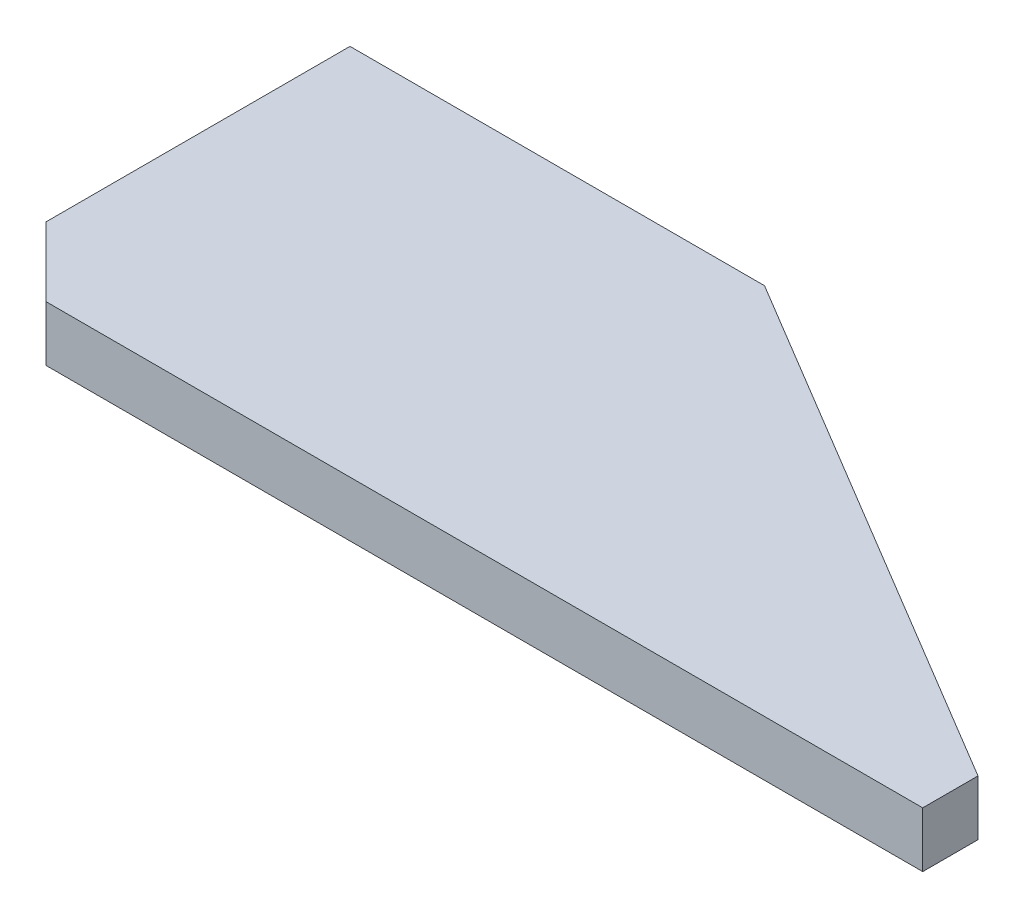
ISO-10303-21;
HEADER;
FILE_DESCRIPTION(('STEP AP214'),'2;1');
FILE_NAME('part.step','',(''),(''),'','','');
FILE_SCHEMA(('AUTOMOTIVE_DESIGN { 1 0 10303 214 1 1 1 1 }'));
ENDSEC;
DATA;
#1=APPLICATION_CONTEXT('core data for automotive mechanical design processes');
#2=APPLICATION_PROTOCOL_DEFINITION('international standard','automotive_design',2000,#1);
#3=PRODUCT_CONTEXT('',#1,'mechanical');
#4=PRODUCT('Part','Part','',(#3));
#5=PRODUCT_RELATED_PRODUCT_CATEGORY('part','',(#4));
#6=PRODUCT_DEFINITION_FORMATION('','',#4);
#7=PRODUCT_DEFINITION_CONTEXT('part definition',#1,'design');
#8=PRODUCT_DEFINITION('design','',#6,#7);
#9=PRODUCT_DEFINITION_SHAPE('','',#8);
#10=(LENGTH_UNIT() NAMED_UNIT(*) SI_UNIT(.MILLI.,.METRE.));
#11=(NAMED_UNIT(*) PLANE_ANGLE_UNIT() SI_UNIT($,.RADIAN.));
#12=(NAMED_UNIT(*) SI_UNIT($,.STERADIAN.) SOLID_ANGLE_UNIT());
#13=UNCERTAINTY_MEASURE_WITH_UNIT(LENGTH_MEASURE(1.E-05),#10,'distance_accuracy_value','');
#14=(GEOMETRIC_REPRESENTATION_CONTEXT(3) GLOBAL_UNCERTAINTY_ASSIGNED_CONTEXT((#13)) GLOBAL_UNIT_ASSIGNED_CONTEXT((#10,
#11,#12)) REPRESENTATION_CONTEXT('',''));
#15=CARTESIAN_POINT('',(0.,0.,0.));
#16=DIRECTION('',(0.,0.,1.));
#17=DIRECTION('',(1.,0.,0.));
#18=AXIS2_PLACEMENT_3D('',#15,#16,#17);
#19=CARTESIAN_POINT('',(471.9,869.,-475.));
#20=DIRECTION('',(1.,0.,0.));
#21=DIRECTION('',(0.,0.,-1.));
#22=AXIS2_PLACEMENT_3D('',#19,#20,#21);
#23=PLANE('',#22);
#24=DIRECTION('',(0.,0.,1.));
#25=VECTOR('',#24,1.);
#26=CARTESIAN_POINT('',(471.9,861.,-475.));
#27=LINE('',#26,#25);
#28=CARTESIAN_POINT('',(471.9,861.,-483.));
#29=VERTEX_POINT('',#28);
#30=CARTESIAN_POINT('',(471.9,861.,-475.));
#31=VERTEX_POINT('',#30);
#32=EDGE_CURVE('E123',#29,#31,#27,.T.);
#33=ORIENTED_EDGE('',*,*,#32,.F.);
#34=DIRECTION('',(0.,-1.,0.));
#35=VECTOR('',#34,1.);
#36=CARTESIAN_POINT('',(471.9,869.,-483.));
#37=LINE('',#36,#35);
#38=CARTESIAN_POINT('',(471.9,869.,-483.));
#39=VERTEX_POINT('',#38);
#40=EDGE_CURVE('E111',#39,#29,#37,.T.);
#41=ORIENTED_EDGE('',*,*,#40,.F.);
#42=DIRECTION('',(0.,0.,1.));
#43=VECTOR('',#42,1.);
#44=CARTESIAN_POINT('',(471.9,869.,-475.));
#45=LINE('',#44,#43);
#46=CARTESIAN_POINT('',(471.9,869.,-475.));
#47=VERTEX_POINT('',#46);
#48=EDGE_CURVE('E106',#39,#47,#45,.T.);
#49=ORIENTED_EDGE('',*,*,#48,.T.);
#50=DIRECTION('',(0.,-1.,0.));
#51=VECTOR('',#50,1.);
#52=CARTESIAN_POINT('',(471.9,869.,-475.));
#53=LINE('',#52,#51);
#54=EDGE_CURVE('E88',#47,#31,#53,.T.);
#55=ORIENTED_EDGE('',*,*,#54,.T.);
#56=EDGE_LOOP('',(#33,#41,#49,#55));
#57=FACE_BOUND('',#56,.T.);
#58=ADVANCED_FACE('F37',(#57),#23,.T.);
#59=CARTESIAN_POINT('',(471.9,869.,-483.));
#60=DIRECTION('',(0.513346500392466,0.,-0.858181432177839));
#61=DIRECTION('',(-0.858181432177839,0.,-0.513346500392466));
#62=AXIS2_PLACEMENT_3D('',#59,#60,#61);
#63=PLANE('',#62);
#64=DIRECTION('',(0.858181432177839,0.,0.513346500392466));
#65=VECTOR('',#64,1.);
#66=CARTESIAN_POINT('',(471.9,861.,-483.));
#67=LINE('',#66,#65);
#68=CARTESIAN_POINT('',(395.,861.,-529.));
#69=VERTEX_POINT('',#68);
#70=EDGE_CURVE('E112',#69,#29,#67,.T.);
#71=ORIENTED_EDGE('',*,*,#70,.F.);
#72=DIRECTION('',(0.,-1.,0.));
#73=VECTOR('',#72,1.);
#74=CARTESIAN_POINT('',(395.,869.,-529.));
#75=LINE('',#74,#73);
#76=CARTESIAN_POINT('',(395.,869.,-529.));
#77=VERTEX_POINT('',#76);
#78=EDGE_CURVE('E132',#77,#69,#75,.T.);
#79=ORIENTED_EDGE('',*,*,#78,.F.);
#80=DIRECTION('',(0.858181432177839,0.,0.513346500392466));
#81=VECTOR('',#80,1.);
#82=CARTESIAN_POINT('',(471.9,869.,-483.));
#83=LINE('',#82,#81);
#84=EDGE_CURVE('E100',#77,#39,#83,.T.);
#85=ORIENTED_EDGE('',*,*,#84,.T.);
#86=ORIENTED_EDGE('',*,*,#40,.T.);
#87=EDGE_LOOP('',(#71,#79,#85,#86));
#88=FACE_BOUND('',#87,.T.);
#89=ADVANCED_FACE('F142',(#88),#63,.T.);
#90=CARTESIAN_POINT('',(395.,869.,-529.));
#91=DIRECTION('',(0.,0.,-1.));
#92=DIRECTION('',(-1.,0.,0.));
#93=AXIS2_PLACEMENT_3D('',#90,#91,#92);
#94=PLANE('',#93);
#95=DIRECTION('',(1.,0.,0.));
#96=VECTOR('',#95,1.);
#97=CARTESIAN_POINT('',(395.,861.,-529.));
#98=LINE('',#97,#96);
#99=CARTESIAN_POINT('',(335.,861.,-529.));
#100=VERTEX_POINT('',#99);
#101=EDGE_CURVE('E115',#100,#69,#98,.T.);
#102=ORIENTED_EDGE('',*,*,#101,.F.);
#103=DIRECTION('',(0.,-1.,0.));
#104=VECTOR('',#103,1.);
#105=CARTESIAN_POINT('',(335.,869.,-529.));
#106=LINE('',#105,#104);
#107=CARTESIAN_POINT('',(335.,869.,-529.));
#108=VERTEX_POINT('',#107);
#109=EDGE_CURVE('E99',#108,#100,#106,.T.);
#110=ORIENTED_EDGE('',*,*,#109,.F.);
#111=DIRECTION('',(1.,0.,0.));
#112=VECTOR('',#111,1.);
#113=CARTESIAN_POINT('',(395.,869.,-529.));
#114=LINE('',#113,#112);
#115=EDGE_CURVE('E119',#108,#77,#114,.T.);
#116=ORIENTED_EDGE('',*,*,#115,.T.);
#117=ORIENTED_EDGE('',*,*,#78,.T.);
#118=EDGE_LOOP('',(#102,#110,#116,#117));
#119=FACE_BOUND('',#118,.T.);
#120=ADVANCED_FACE('F146',(#119),#94,.T.);
#121=CARTESIAN_POINT('',(335.,869.,-529.));
#122=DIRECTION('',(-1.,0.,0.));
#123=DIRECTION('',(0.,0.,1.));
#124=AXIS2_PLACEMENT_3D('',#121,#122,#123);
#125=PLANE('',#124);
#126=DIRECTION('',(0.,0.,-1.));
#127=VECTOR('',#126,1.);
#128=CARTESIAN_POINT('',(335.,861.,-529.));
#129=LINE('',#128,#127);
#130=CARTESIAN_POINT('',(335.,861.,-485.));
#131=VERTEX_POINT('',#130);
#132=EDGE_CURVE('E126',#131,#100,#129,.T.);
#133=ORIENTED_EDGE('',*,*,#132,.F.);
#134=DIRECTION('',(0.,1.,0.));
#135=VECTOR('',#134,1.);
#136=CARTESIAN_POINT('',(335.,869.,-485.));
#137=LINE('',#136,#135);
#138=CARTESIAN_POINT('',(335.,869.,-485.));
#139=VERTEX_POINT('',#138);
#140=EDGE_CURVE('E45',#131,#139,#137,.T.);
#141=ORIENTED_EDGE('',*,*,#140,.T.);
#142=DIRECTION('',(0.,0.,-1.));
#143=VECTOR('',#142,1.);
#144=CARTESIAN_POINT('',(335.,869.,-529.));
#145=LINE('',#144,#143);
#146=EDGE_CURVE('E109',#139,#108,#145,.T.);
#147=ORIENTED_EDGE('',*,*,#146,.T.);
#148=ORIENTED_EDGE('',*,*,#109,.T.);
#149=EDGE_LOOP('',(#133,#141,#147,#148));
#150=FACE_BOUND('',#149,.T.);
#151=ADVANCED_FACE('F147',(#150),#125,.T.);
#152=CARTESIAN_POINT('',(335.,869.,-475.));
#153=DIRECTION('',(0.,0.,1.));
#154=DIRECTION('',(1.,0.,0.));
#155=AXIS2_PLACEMENT_3D('',#152,#153,#154);
#156=PLANE('',#155);
#157=DIRECTION('',(-1.,0.,0.));
#158=VECTOR('',#157,1.);
#159=CARTESIAN_POINT('',(335.,869.,-475.));
#160=LINE('',#159,#158);
#161=CARTESIAN_POINT('',(345.,869.,-475.));
#162=VERTEX_POINT('',#161);
#163=EDGE_CURVE('E92',#47,#162,#160,.T.);
#164=ORIENTED_EDGE('',*,*,#163,.T.);
#165=DIRECTION('',(0.,-1.,0.));
#166=VECTOR('',#165,1.);
#167=CARTESIAN_POINT('',(345.,869.,-475.));
#168=LINE('',#167,#166);
#169=CARTESIAN_POINT('',(345.,861.,-475.));
#170=VERTEX_POINT('',#169);
#171=EDGE_CURVE('E131',#162,#170,#168,.T.);
#172=ORIENTED_EDGE('',*,*,#171,.T.);
#173=DIRECTION('',(-1.,0.,0.));
#174=VECTOR('',#173,1.);
#175=CARTESIAN_POINT('',(335.,861.,-475.));
#176=LINE('',#175,#174);
#177=EDGE_CURVE('E94',#31,#170,#176,.T.);
#178=ORIENTED_EDGE('',*,*,#177,.F.);
#179=ORIENTED_EDGE('',*,*,#54,.F.);
#180=EDGE_LOOP('',(#164,#172,#178,#179));
#181=FACE_BOUND('',#180,.T.);
#182=ADVANCED_FACE('F90',(#181),#156,.T.);
#183=CARTESIAN_POINT('',(0.,869.,0.));
#184=DIRECTION('',(0.,1.,0.));
#185=DIRECTION('',(0.,0.,1.));
#186=AXIS2_PLACEMENT_3D('',#183,#184,#185);
#187=PLANE('',#186);
#188=ORIENTED_EDGE('',*,*,#146,.F.);
#189=DIRECTION('',(-0.707106781186546,0.,-0.707106781186549));
#190=VECTOR('',#189,1.);
#191=CARTESIAN_POINT('',(410.000000000001,869.,-409.999999999999));
#192=LINE('',#191,#190);
#193=EDGE_CURVE('E11',#139,#162,#192,.F.);
#194=ORIENTED_EDGE('',*,*,#193,.T.);
#195=ORIENTED_EDGE('',*,*,#163,.F.);
#196=ORIENTED_EDGE('',*,*,#48,.F.);
#197=ORIENTED_EDGE('',*,*,#84,.F.);
#198=ORIENTED_EDGE('',*,*,#115,.F.);
#199=EDGE_LOOP('',(#188,#194,#195,#196,#197,#198));
#200=FACE_BOUND('',#199,.T.);
#201=ADVANCED_FACE('F104',(#200),#187,.T.);
#202=CARTESIAN_POINT('',(0.,861.,0.));
#203=DIRECTION('',(0.,1.,0.));
#204=DIRECTION('',(0.,0.,1.));
#205=AXIS2_PLACEMENT_3D('',#202,#203,#204);
#206=PLANE('',#205);
#207=ORIENTED_EDGE('',*,*,#177,.T.);
#208=DIRECTION('',(0.707106781186546,0.,0.707106781186549));
#209=VECTOR('',#208,1.);
#210=CARTESIAN_POINT('',(345.,861.,-475.));
#211=LINE('',#210,#209);
#212=EDGE_CURVE('E59',#170,#131,#211,.F.);
#213=ORIENTED_EDGE('',*,*,#212,.T.);
#214=ORIENTED_EDGE('',*,*,#132,.T.);
#215=ORIENTED_EDGE('',*,*,#101,.T.);
#216=ORIENTED_EDGE('',*,*,#70,.T.);
#217=ORIENTED_EDGE('',*,*,#32,.T.);
#218=EDGE_LOOP('',(#207,#213,#214,#215,#216,#217));
#219=FACE_BOUND('',#218,.T.);
#220=ADVANCED_FACE('F138',(#219),#206,.F.);
#221=CARTESIAN_POINT('',(345.,869.,-475.));
#222=DIRECTION('',(0.707106781186549,0.,-0.707106781186546));
#223=DIRECTION('',(0.,-1.,0.));
#224=AXIS2_PLACEMENT_3D('',#221,#222,#223);
#225=PLANE('',#224);
#226=ORIENTED_EDGE('',*,*,#193,.F.);
#227=ORIENTED_EDGE('',*,*,#140,.F.);
#228=ORIENTED_EDGE('',*,*,#212,.F.);
#229=ORIENTED_EDGE('',*,*,#171,.F.);
#230=EDGE_LOOP('',(#226,#227,#228,#229));
#231=FACE_BOUND('',#230,.T.);
#232=ADVANCED_FACE('F39',(#231),#225,.F.);
#233=CLOSED_SHELL('',(#58,#89,#120,#151,#182,#201,#220,#232));
#234=MANIFOLD_SOLID_BREP('B2',#233);
#235=ADVANCED_BREP_SHAPE_REPRESENTATION('',(#18,#234),#14);
#236=SHAPE_DEFINITION_REPRESENTATION(#9,#235);
ENDSEC;
END-ISO-10303-21;
